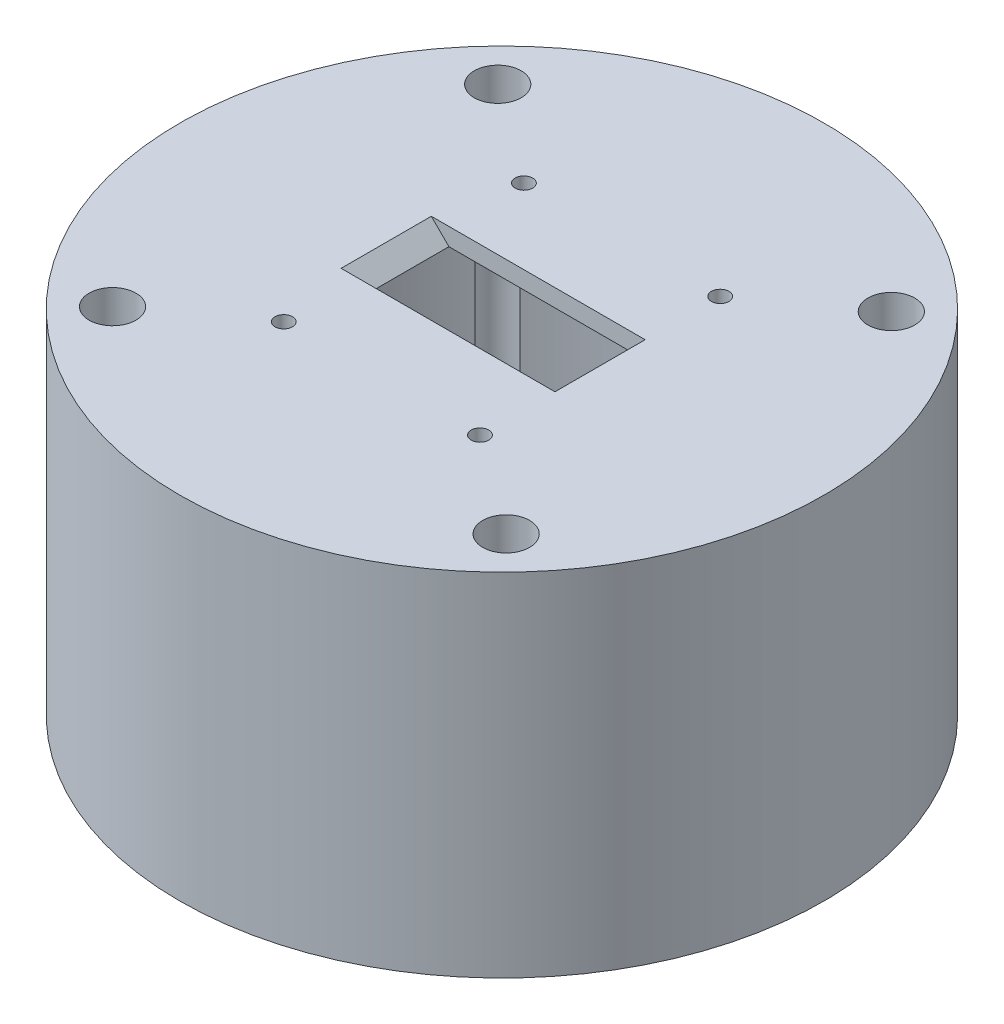
ISO-10303-21;
HEADER;
FILE_DESCRIPTION(('STEP AP214'),'2;1');
FILE_NAME('part.step','',(''),(''),'','','');
FILE_SCHEMA(('AUTOMOTIVE_DESIGN { 1 0 10303 214 1 1 1 1 }'));
ENDSEC;
DATA;
#1=APPLICATION_CONTEXT('core data for automotive mechanical design processes');
#2=APPLICATION_PROTOCOL_DEFINITION('international standard','automotive_design',2000,#1);
#3=PRODUCT_CONTEXT('',#1,'mechanical');
#4=PRODUCT('Part','Part','',(#3));
#5=PRODUCT_RELATED_PRODUCT_CATEGORY('part','',(#4));
#6=PRODUCT_DEFINITION_FORMATION('','',#4);
#7=PRODUCT_DEFINITION_CONTEXT('part definition',#1,'design');
#8=PRODUCT_DEFINITION('design','',#6,#7);
#9=PRODUCT_DEFINITION_SHAPE('','',#8);
#10=(LENGTH_UNIT() NAMED_UNIT(*) SI_UNIT(.MILLI.,.METRE.));
#11=(NAMED_UNIT(*) PLANE_ANGLE_UNIT() SI_UNIT($,.RADIAN.));
#12=(NAMED_UNIT(*) SI_UNIT($,.STERADIAN.) SOLID_ANGLE_UNIT());
#13=UNCERTAINTY_MEASURE_WITH_UNIT(LENGTH_MEASURE(1.E-05),#10,'distance_accuracy_value','');
#14=(GEOMETRIC_REPRESENTATION_CONTEXT(3) GLOBAL_UNCERTAINTY_ASSIGNED_CONTEXT((#13)) GLOBAL_UNIT_ASSIGNED_CONTEXT((#10,
#11,#12)) REPRESENTATION_CONTEXT('',''));
#15=CARTESIAN_POINT('',(0.,0.,0.));
#16=DIRECTION('',(0.,0.,1.));
#17=DIRECTION('',(1.,0.,0.));
#18=AXIS2_PLACEMENT_3D('',#15,#16,#17);
#19=CARTESIAN_POINT('',(16.75,60.,-7.7));
#20=DIRECTION('',(1.,0.,0.));
#21=DIRECTION('',(0.,0.,-1.));
#22=AXIS2_PLACEMENT_3D('',#19,#20,#21);
#23=PLANE('',#22);
#24=DIRECTION('',(0.,0.,-1.));
#25=VECTOR('',#24,1.);
#26=CARTESIAN_POINT('',(16.75,57.,-7.7));
#27=LINE('',#26,#25);
#28=CARTESIAN_POINT('',(16.75,57.,7.7));
#29=VERTEX_POINT('',#28);
#30=CARTESIAN_POINT('',(16.75,57.,-7.7));
#31=VERTEX_POINT('',#30);
#32=EDGE_CURVE('E262',#29,#31,#27,.T.);
#33=ORIENTED_EDGE('',*,*,#32,.F.);
#34=DIRECTION('',(0.,-1.,0.));
#35=VECTOR('',#34,1.);
#36=CARTESIAN_POINT('',(16.75,60.,7.7));
#37=LINE('',#36,#35);
#38=CARTESIAN_POINT('',(16.75,60.,7.7));
#39=VERTEX_POINT('',#38);
#40=EDGE_CURVE('E328',#39,#29,#37,.T.);
#41=ORIENTED_EDGE('',*,*,#40,.F.);
#42=DIRECTION('',(0.,0.,1.));
#43=VECTOR('',#42,1.);
#44=CARTESIAN_POINT('',(16.75,60.,-7.7));
#45=LINE('',#44,#43);
#46=CARTESIAN_POINT('',(16.75,60.,-7.7));
#47=VERTEX_POINT('',#46);
#48=EDGE_CURVE('E324',#47,#39,#45,.T.);
#49=ORIENTED_EDGE('',*,*,#48,.F.);
#50=DIRECTION('',(0.,-1.,0.));
#51=VECTOR('',#50,1.);
#52=CARTESIAN_POINT('',(16.75,60.,-7.7));
#53=LINE('',#52,#51);
#54=EDGE_CURVE('E329',#47,#31,#53,.T.);
#55=ORIENTED_EDGE('',*,*,#54,.T.);
#56=EDGE_LOOP('',(#33,#41,#49,#55));
#57=FACE_BOUND('',#56,.T.);
#58=ADVANCED_FACE('F32',(#57),#23,.F.);
#59=CARTESIAN_POINT('',(-16.75,60.,-7.7));
#60=DIRECTION('',(0.,0.,-1.));
#61=DIRECTION('',(-1.,0.,0.));
#62=AXIS2_PLACEMENT_3D('',#59,#60,#61);
#63=PLANE('',#62);
#64=DIRECTION('',(-1.,0.,0.));
#65=VECTOR('',#64,1.);
#66=CARTESIAN_POINT('',(-16.75,57.,-7.7));
#67=LINE('',#66,#65);
#68=CARTESIAN_POINT('',(-16.75,57.,-7.7));
#69=VERTEX_POINT('',#68);
#70=EDGE_CURVE('E259',#31,#69,#67,.T.);
#71=ORIENTED_EDGE('',*,*,#70,.F.);
#72=ORIENTED_EDGE('',*,*,#54,.F.);
#73=DIRECTION('',(1.,0.,0.));
#74=VECTOR('',#73,1.);
#75=CARTESIAN_POINT('',(-16.75,60.,-7.7));
#76=LINE('',#75,#74);
#77=CARTESIAN_POINT('',(-19.75,60.,-7.7));
#78=VERTEX_POINT('',#77);
#79=EDGE_CURVE('E47',#78,#47,#76,.T.);
#80=ORIENTED_EDGE('',*,*,#79,.F.);
#81=DIRECTION('',(0.707106781186546,-0.707106781186549,0.));
#82=VECTOR('',#81,1.);
#83=CARTESIAN_POINT('',(-18.25,58.5,-7.7));
#84=LINE('',#83,#82);
#85=EDGE_CURVE('E40',#78,#69,#84,.T.);
#86=ORIENTED_EDGE('',*,*,#85,.T.);
#87=EDGE_LOOP('',(#71,#72,#80,#86));
#88=FACE_BOUND('',#87,.T.);
#89=ADVANCED_FACE('F362',(#88),#63,.F.);
#90=CARTESIAN_POINT('',(-16.75,60.,7.7));
#91=DIRECTION('',(0.,0.,1.));
#92=DIRECTION('',(1.,0.,0.));
#93=AXIS2_PLACEMENT_3D('',#90,#91,#92);
#94=PLANE('',#93);
#95=DIRECTION('',(1.,0.,0.));
#96=VECTOR('',#95,1.);
#97=CARTESIAN_POINT('',(-16.75,57.,7.7));
#98=LINE('',#97,#96);
#99=CARTESIAN_POINT('',(-16.75,57.,7.7));
#100=VERTEX_POINT('',#99);
#101=EDGE_CURVE('E255',#100,#29,#98,.T.);
#102=ORIENTED_EDGE('',*,*,#101,.F.);
#103=DIRECTION('',(-0.707106781186546,0.707106781186549,0.));
#104=VECTOR('',#103,1.);
#105=CARTESIAN_POINT('',(-18.25,58.5,7.7));
#106=LINE('',#105,#104);
#107=CARTESIAN_POINT('',(-19.75,60.,7.7));
#108=VERTEX_POINT('',#107);
#109=EDGE_CURVE('E11',#100,#108,#106,.T.);
#110=ORIENTED_EDGE('',*,*,#109,.T.);
#111=DIRECTION('',(-1.,0.,0.));
#112=VECTOR('',#111,1.);
#113=CARTESIAN_POINT('',(-16.75,60.,7.7));
#114=LINE('',#113,#112);
#115=EDGE_CURVE('E55',#39,#108,#114,.T.);
#116=ORIENTED_EDGE('',*,*,#115,.F.);
#117=ORIENTED_EDGE('',*,*,#40,.T.);
#118=EDGE_LOOP('',(#102,#110,#116,#117));
#119=FACE_BOUND('',#118,.T.);
#120=ADVANCED_FACE('F370',(#119),#94,.F.);
#121=CARTESIAN_POINT('',(-16.75,0.,-20.5));
#122=DIRECTION('',(0.,1.,0.));
#123=DIRECTION('',(0.,0.,1.));
#124=AXIS2_PLACEMENT_3D('',#121,#122,#123);
#125=CYLINDRICAL_SURFACE('',#124,1.5);
#126=CARTESIAN_POINT('',(-16.75,60.,-20.5));
#127=DIRECTION('',(0.,1.,0.));
#128=DIRECTION('',(0.,0.,1.));
#129=AXIS2_PLACEMENT_3D('',#126,#127,#128);
#130=CIRCLE('',#129,1.5);
#131=CARTESIAN_POINT('',(-16.75,60.,-19.));
#132=VERTEX_POINT('',#131);
#133=EDGE_CURVE('E321',#132,#132,#130,.T.);
#134=ORIENTED_EDGE('',*,*,#133,.T.);
#135=EDGE_LOOP('',(#134));
#136=FACE_BOUND('',#135,.T.);
#137=CARTESIAN_POINT('',(-16.75,57.,-20.5));
#138=DIRECTION('',(0.,-1.,0.));
#139=DIRECTION('',(0.,0.,-1.));
#140=AXIS2_PLACEMENT_3D('',#137,#138,#139);
#141=CIRCLE('',#140,1.5);
#142=CARTESIAN_POINT('',(-16.75,57.,-22.));
#143=VERTEX_POINT('',#142);
#144=EDGE_CURVE('E252',#143,#143,#141,.F.);
#145=ORIENTED_EDGE('',*,*,#144,.F.);
#146=EDGE_LOOP('',(#145));
#147=FACE_BOUND('',#146,.T.);
#148=ADVANCED_FACE('F459',(#136,#147),#125,.F.);
#149=CARTESIAN_POINT('',(16.75,0.,-20.5));
#150=DIRECTION('',(0.,1.,0.));
#151=DIRECTION('',(0.,0.,1.));
#152=AXIS2_PLACEMENT_3D('',#149,#150,#151);
#153=CYLINDRICAL_SURFACE('',#152,1.5);
#154=CARTESIAN_POINT('',(16.75,60.,-20.5));
#155=DIRECTION('',(0.,1.,0.));
#156=DIRECTION('',(0.,0.,1.));
#157=AXIS2_PLACEMENT_3D('',#154,#155,#156);
#158=CIRCLE('',#157,1.5);
#159=CARTESIAN_POINT('',(16.75,60.,-19.));
#160=VERTEX_POINT('',#159);
#161=EDGE_CURVE('E289',#160,#160,#158,.T.);
#162=ORIENTED_EDGE('',*,*,#161,.T.);
#163=EDGE_LOOP('',(#162));
#164=FACE_BOUND('',#163,.T.);
#165=CARTESIAN_POINT('',(16.75,57.,-20.5));
#166=DIRECTION('',(0.,-1.,0.));
#167=DIRECTION('',(0.,0.,-1.));
#168=AXIS2_PLACEMENT_3D('',#165,#166,#167);
#169=CIRCLE('',#168,1.5);
#170=CARTESIAN_POINT('',(16.75,57.,-22.));
#171=VERTEX_POINT('',#170);
#172=EDGE_CURVE('E249',#171,#171,#169,.F.);
#173=ORIENTED_EDGE('',*,*,#172,.F.);
#174=EDGE_LOOP('',(#173));
#175=FACE_BOUND('',#174,.T.);
#176=ADVANCED_FACE('F455',(#164,#175),#153,.F.);
#177=CARTESIAN_POINT('',(-16.75,0.,20.5));
#178=DIRECTION('',(0.,1.,0.));
#179=DIRECTION('',(0.,0.,1.));
#180=AXIS2_PLACEMENT_3D('',#177,#178,#179);
#181=CYLINDRICAL_SURFACE('',#180,1.5);
#182=CARTESIAN_POINT('',(-16.75,60.,20.5));
#183=DIRECTION('',(0.,1.,0.));
#184=DIRECTION('',(0.,0.,1.));
#185=AXIS2_PLACEMENT_3D('',#182,#183,#184);
#186=CIRCLE('',#185,1.5);
#187=CARTESIAN_POINT('',(-16.75,60.,22.));
#188=VERTEX_POINT('',#187);
#189=EDGE_CURVE('E293',#188,#188,#186,.T.);
#190=ORIENTED_EDGE('',*,*,#189,.T.);
#191=EDGE_LOOP('',(#190));
#192=FACE_BOUND('',#191,.T.);
#193=CARTESIAN_POINT('',(-16.75,57.,20.5));
#194=DIRECTION('',(0.,-1.,0.));
#195=DIRECTION('',(0.,0.,-1.));
#196=AXIS2_PLACEMENT_3D('',#193,#194,#195);
#197=CIRCLE('',#196,1.5);
#198=CARTESIAN_POINT('',(-16.75,57.,19.));
#199=VERTEX_POINT('',#198);
#200=EDGE_CURVE('E246',#199,#199,#197,.F.);
#201=ORIENTED_EDGE('',*,*,#200,.F.);
#202=EDGE_LOOP('',(#201));
#203=FACE_BOUND('',#202,.T.);
#204=ADVANCED_FACE('F458',(#192,#203),#181,.F.);
#205=CARTESIAN_POINT('',(16.75,0.,20.5));
#206=DIRECTION('',(0.,1.,0.));
#207=DIRECTION('',(0.,0.,1.));
#208=AXIS2_PLACEMENT_3D('',#205,#206,#207);
#209=CYLINDRICAL_SURFACE('',#208,1.5);
#210=CARTESIAN_POINT('',(16.75,60.,20.5));
#211=DIRECTION('',(0.,1.,0.));
#212=DIRECTION('',(0.,0.,1.));
#213=AXIS2_PLACEMENT_3D('',#210,#211,#212);
#214=CIRCLE('',#213,1.5);
#215=CARTESIAN_POINT('',(16.75,60.,22.));
#216=VERTEX_POINT('',#215);
#217=EDGE_CURVE('E268',#216,#216,#214,.T.);
#218=ORIENTED_EDGE('',*,*,#217,.T.);
#219=EDGE_LOOP('',(#218));
#220=FACE_BOUND('',#219,.T.);
#221=CARTESIAN_POINT('',(16.75,57.,20.5));
#222=DIRECTION('',(0.,-1.,0.));
#223=DIRECTION('',(0.,0.,-1.));
#224=AXIS2_PLACEMENT_3D('',#221,#222,#223);
#225=CIRCLE('',#224,1.5);
#226=CARTESIAN_POINT('',(16.75,57.,19.));
#227=VERTEX_POINT('',#226);
#228=EDGE_CURVE('E234',#227,#227,#225,.F.);
#229=ORIENTED_EDGE('',*,*,#228,.F.);
#230=EDGE_LOOP('',(#229));
#231=FACE_BOUND('',#230,.T.);
#232=ADVANCED_FACE('F463',(#220,#231),#209,.F.);
#233=CARTESIAN_POINT('',(0.,50.,0.));
#234=DIRECTION('',(0.,-1.,0.));
#235=DIRECTION('',(0.,0.,-1.));
#236=AXIS2_PLACEMENT_3D('',#233,#234,#235);
#237=CYLINDRICAL_SURFACE('',#236,50.);
#238=CARTESIAN_POINT('',(0.,50.,0.));
#239=DIRECTION('',(0.,-1.,0.));
#240=DIRECTION('',(0.,0.,-1.));
#241=AXIS2_PLACEMENT_3D('',#238,#239,#240);
#242=CIRCLE('',#241,50.);
#243=CARTESIAN_POINT('',(37.590562846943,50.,-32.9689184664895));
#244=VERTEX_POINT('',#243);
#245=CARTESIAN_POINT('',(37.590562846943,50.,32.9689184664894));
#246=VERTEX_POINT('',#245);
#247=EDGE_CURVE('E340',#244,#246,#242,.T.);
#248=ORIENTED_EDGE('',*,*,#247,.F.);
#249=DIRECTION('',(0.,1.,0.));
#250=VECTOR('',#249,1.);
#251=CARTESIAN_POINT('',(37.5905628469429,30.,-32.9689184664895));
#252=LINE('',#251,#250);
#253=CARTESIAN_POINT('',(37.5905628469429,0.,-32.9689184664896));
#254=VERTEX_POINT('',#253);
#255=EDGE_CURVE('E318',#244,#254,#252,.F.);
#256=ORIENTED_EDGE('',*,*,#255,.T.);
#257=CARTESIAN_POINT('',(0.,0.,0.));
#258=DIRECTION('',(0.,-1.,0.));
#259=DIRECTION('',(0.,0.,-1.));
#260=AXIS2_PLACEMENT_3D('',#257,#258,#259);
#261=CIRCLE('',#260,50.);
#262=CARTESIAN_POINT('',(37.5905628469429,0.,32.9689184664895));
#263=VERTEX_POINT('',#262);
#264=EDGE_CURVE('E339',#254,#263,#261,.T.);
#265=ORIENTED_EDGE('',*,*,#264,.T.);
#266=DIRECTION('',(0.,1.,0.));
#267=VECTOR('',#266,1.);
#268=CARTESIAN_POINT('',(37.5905628469429,30.,32.9689184664894));
#269=LINE('',#268,#267);
#270=EDGE_CURVE('E292',#263,#246,#269,.T.);
#271=ORIENTED_EDGE('',*,*,#270,.T.);
#272=EDGE_LOOP('',(#248,#256,#265,#271));
#273=FACE_BOUND('',#272,.T.);
#274=ADVANCED_FACE('F397',(#273),#237,.F.);
#275=CARTESIAN_POINT('',(-33.7747495446768,0.,-36.868228777558));
#276=VERTEX_POINT('',#275);
#277=CARTESIAN_POINT('',(33.7747495446768,0.,-36.868228777558));
#278=VERTEX_POINT('',#277);
#279=EDGE_CURVE('E332',#276,#278,#261,.T.);
#280=ORIENTED_EDGE('',*,*,#279,.T.);
#281=DIRECTION('',(0.,1.,0.));
#282=VECTOR('',#281,1.);
#283=CARTESIAN_POINT('',(33.7747495446767,30.,-36.868228777558));
#284=LINE('',#283,#282);
#285=CARTESIAN_POINT('',(33.7747495446767,50.,-36.8682287775581));
#286=VERTEX_POINT('',#285);
#287=EDGE_CURVE('E315',#278,#286,#284,.T.);
#288=ORIENTED_EDGE('',*,*,#287,.T.);
#289=CARTESIAN_POINT('',(-33.7747495446767,50.,-36.8682287775581));
#290=VERTEX_POINT('',#289);
#291=EDGE_CURVE('E335',#290,#286,#242,.T.);
#292=ORIENTED_EDGE('',*,*,#291,.F.);
#293=DIRECTION('',(0.,1.,0.));
#294=VECTOR('',#293,1.);
#295=CARTESIAN_POINT('',(-33.7747495446767,30.,-36.868228777558));
#296=LINE('',#295,#294);
#297=EDGE_CURVE('E312',#290,#276,#296,.F.);
#298=ORIENTED_EDGE('',*,*,#297,.T.);
#299=EDGE_LOOP('',(#280,#288,#292,#298));
#300=FACE_BOUND('',#299,.T.);
#301=ADVANCED_FACE('F440',(#300),#237,.F.);
#302=CARTESIAN_POINT('',(-37.5905628469429,0.,32.9689184664895));
#303=VERTEX_POINT('',#302);
#304=CARTESIAN_POINT('',(-37.5905628469429,0.,-32.9689184664895));
#305=VERTEX_POINT('',#304);
#306=EDGE_CURVE('E343',#303,#305,#261,.T.);
#307=ORIENTED_EDGE('',*,*,#306,.T.);
#308=DIRECTION('',(0.,1.,0.));
#309=VECTOR('',#308,1.);
#310=CARTESIAN_POINT('',(-37.5905628469429,30.,-32.9689184664894));
#311=LINE('',#310,#309);
#312=CARTESIAN_POINT('',(-37.590562846943,50.,-32.9689184664894));
#313=VERTEX_POINT('',#312);
#314=EDGE_CURVE('E309',#305,#313,#311,.T.);
#315=ORIENTED_EDGE('',*,*,#314,.T.);
#316=CARTESIAN_POINT('',(-37.590562846943,50.,32.9689184664894));
#317=VERTEX_POINT('',#316);
#318=EDGE_CURVE('E338',#317,#313,#242,.T.);
#319=ORIENTED_EDGE('',*,*,#318,.F.);
#320=DIRECTION('',(0.,1.,0.));
#321=VECTOR('',#320,1.);
#322=CARTESIAN_POINT('',(-37.5905628469429,30.,32.9689184664894));
#323=LINE('',#322,#321);
#324=EDGE_CURVE('E306',#317,#303,#323,.F.);
#325=ORIENTED_EDGE('',*,*,#324,.T.);
#326=EDGE_LOOP('',(#307,#315,#319,#325));
#327=FACE_BOUND('',#326,.T.);
#328=ADVANCED_FACE('F384',(#327),#237,.F.);
#329=CARTESIAN_POINT('',(0.,60.,0.));
#330=DIRECTION('',(0.,-1.,0.));
#331=DIRECTION('',(0.,0.,-1.));
#332=AXIS2_PLACEMENT_3D('',#329,#330,#331);
#333=CYLINDRICAL_SURFACE('',#332,55.);
#334=CARTESIAN_POINT('',(0.,60.,0.));
#335=DIRECTION('',(0.,1.,0.));
#336=DIRECTION('',(0.,0.,1.));
#337=AXIS2_PLACEMENT_3D('',#334,#335,#336);
#338=CIRCLE('',#337,55.);
#339=CARTESIAN_POINT('',(0.,60.,55.));
#340=VERTEX_POINT('',#339);
#341=EDGE_CURVE('E344',#340,#340,#338,.T.);
#342=ORIENTED_EDGE('',*,*,#341,.F.);
#343=EDGE_LOOP('',(#342));
#344=FACE_BOUND('',#343,.T.);
#345=CARTESIAN_POINT('',(0.,0.,0.));
#346=DIRECTION('',(0.,1.,0.));
#347=DIRECTION('',(0.,0.,1.));
#348=AXIS2_PLACEMENT_3D('',#345,#346,#347);
#349=CIRCLE('',#348,55.);
#350=CARTESIAN_POINT('',(0.,0.,55.));
#351=VERTEX_POINT('',#350);
#352=EDGE_CURVE('E348',#351,#351,#349,.T.);
#353=ORIENTED_EDGE('',*,*,#352,.T.);
#354=EDGE_LOOP('',(#353));
#355=FACE_BOUND('',#354,.T.);
#356=ADVANCED_FACE('F377',(#344,#355),#333,.T.);
#357=CARTESIAN_POINT('',(0.,60.,0.));
#358=DIRECTION('',(0.,1.,0.));
#359=DIRECTION('',(0.,0.,1.));
#360=AXIS2_PLACEMENT_3D('',#357,#358,#359);
#361=PLANE('',#360);
#362=CARTESIAN_POINT('',(33.5917270558466,60.,-32.8724181253145));
#363=DIRECTION('',(0.,1.,0.));
#364=DIRECTION('',(0.,0.,1.));
#365=AXIS2_PLACEMENT_3D('',#362,#363,#364);
#366=CIRCLE('',#365,4.);
#367=CARTESIAN_POINT('',(33.5917270558466,60.,-28.8724181253145));
#368=VERTEX_POINT('',#367);
#369=EDGE_CURVE('E264',#368,#368,#366,.T.);
#370=ORIENTED_EDGE('',*,*,#369,.F.);
#371=EDGE_LOOP('',(#370));
#372=FACE_BOUND('',#371,.T.);
#373=CARTESIAN_POINT('',(-33.5917270558466,60.,-32.8724181253145));
#374=DIRECTION('',(0.,1.,0.));
#375=DIRECTION('',(0.,0.,1.));
#376=AXIS2_PLACEMENT_3D('',#373,#374,#375);
#377=CIRCLE('',#376,4.);
#378=CARTESIAN_POINT('',(-33.5917270558466,60.,-28.8724181253145));
#379=VERTEX_POINT('',#378);
#380=EDGE_CURVE('E281',#379,#379,#377,.T.);
#381=ORIENTED_EDGE('',*,*,#380,.F.);
#382=EDGE_LOOP('',(#381));
#383=FACE_BOUND('',#382,.T.);
#384=CARTESIAN_POINT('',(-33.5917270558466,60.,32.8724181253145));
#385=DIRECTION('',(0.,1.,0.));
#386=DIRECTION('',(0.,0.,1.));
#387=AXIS2_PLACEMENT_3D('',#384,#385,#386);
#388=CIRCLE('',#387,4.);
#389=CARTESIAN_POINT('',(-33.5917270558466,60.,36.8724181253145));
#390=VERTEX_POINT('',#389);
#391=EDGE_CURVE('E275',#390,#390,#388,.T.);
#392=ORIENTED_EDGE('',*,*,#391,.F.);
#393=EDGE_LOOP('',(#392));
#394=FACE_BOUND('',#393,.T.);
#395=CARTESIAN_POINT('',(33.5917270558466,60.,32.8724181253145));
#396=DIRECTION('',(0.,1.,0.));
#397=DIRECTION('',(0.,0.,1.));
#398=AXIS2_PLACEMENT_3D('',#395,#396,#397);
#399=CIRCLE('',#398,4.00000000000001);
#400=CARTESIAN_POINT('',(33.5917270558466,60.,36.8724181253145));
#401=VERTEX_POINT('',#400);
#402=EDGE_CURVE('E269',#401,#401,#399,.T.);
#403=ORIENTED_EDGE('',*,*,#402,.F.);
#404=EDGE_LOOP('',(#403));
#405=FACE_BOUND('',#404,.T.);
#406=ORIENTED_EDGE('',*,*,#217,.F.);
#407=EDGE_LOOP('',(#406));
#408=FACE_BOUND('',#407,.T.);
#409=ORIENTED_EDGE('',*,*,#189,.F.);
#410=EDGE_LOOP('',(#409));
#411=FACE_BOUND('',#410,.T.);
#412=ORIENTED_EDGE('',*,*,#161,.F.);
#413=EDGE_LOOP('',(#412));
#414=FACE_BOUND('',#413,.T.);
#415=ORIENTED_EDGE('',*,*,#133,.F.);
#416=EDGE_LOOP('',(#415));
#417=FACE_BOUND('',#416,.T.);
#418=DIRECTION('',(0.,0.,-1.));
#419=VECTOR('',#418,1.);
#420=CARTESIAN_POINT('',(-19.75,60.,-7.7));
#421=LINE('',#420,#419);
#422=EDGE_CURVE('E358',#108,#78,#421,.T.);
#423=ORIENTED_EDGE('',*,*,#422,.T.);
#424=ORIENTED_EDGE('',*,*,#79,.T.);
#425=ORIENTED_EDGE('',*,*,#48,.T.);
#426=ORIENTED_EDGE('',*,*,#115,.T.);
#427=EDGE_LOOP('',(#423,#424,#425,#426));
#428=FACE_BOUND('',#427,.T.);
#429=ORIENTED_EDGE('',*,*,#341,.T.);
#430=EDGE_LOOP('',(#429));
#431=FACE_BOUND('',#430,.T.);
#432=ADVANCED_FACE('F373',(#372,#383,#394,#405,#408,#411,#414,#417,#428,#431),#361,.T.);
#433=CARTESIAN_POINT('',(0.,0.,0.));
#434=DIRECTION('',(0.,1.,0.));
#435=DIRECTION('',(0.,0.,1.));
#436=AXIS2_PLACEMENT_3D('',#433,#434,#435);
#437=PLANE('',#436);
#438=ORIENTED_EDGE('',*,*,#264,.F.);
#439=CARTESIAN_POINT('',(33.5917270558466,0.,-32.8724181253145));
#440=DIRECTION('',(0.,1.,0.));
#441=DIRECTION('',(0.,0.,1.));
#442=AXIS2_PLACEMENT_3D('',#439,#440,#441);
#443=CIRCLE('',#442,4.);
#444=EDGE_CURVE('E284',#254,#278,#443,.T.);
#445=ORIENTED_EDGE('',*,*,#444,.T.);
#446=ORIENTED_EDGE('',*,*,#279,.F.);
#447=CARTESIAN_POINT('',(-33.5917270558466,0.,-32.8724181253145));
#448=DIRECTION('',(0.,1.,0.));
#449=DIRECTION('',(0.,0.,1.));
#450=AXIS2_PLACEMENT_3D('',#447,#448,#449);
#451=CIRCLE('',#450,4.);
#452=EDGE_CURVE('E278',#276,#305,#451,.T.);
#453=ORIENTED_EDGE('',*,*,#452,.T.);
#454=ORIENTED_EDGE('',*,*,#306,.F.);
#455=CARTESIAN_POINT('',(-33.5917270558466,0.,32.8724181253145));
#456=DIRECTION('',(0.,1.,0.));
#457=DIRECTION('',(0.,0.,1.));
#458=AXIS2_PLACEMENT_3D('',#455,#456,#457);
#459=CIRCLE('',#458,4.);
#460=CARTESIAN_POINT('',(-33.7747495446768,0.,36.868228777558));
#461=VERTEX_POINT('',#460);
#462=EDGE_CURVE('E272',#303,#461,#459,.T.);
#463=ORIENTED_EDGE('',*,*,#462,.T.);
#464=CARTESIAN_POINT('',(33.7747495446768,0.,36.868228777558));
#465=VERTEX_POINT('',#464);
#466=EDGE_CURVE('E686',#465,#461,#261,.T.);
#467=ORIENTED_EDGE('',*,*,#466,.F.);
#468=CARTESIAN_POINT('',(33.5917270558466,0.,32.8724181253145));
#469=DIRECTION('',(0.,1.,0.));
#470=DIRECTION('',(0.,0.,1.));
#471=AXIS2_PLACEMENT_3D('',#468,#469,#470);
#472=CIRCLE('',#471,4.00000000000001);
#473=EDGE_CURVE('E265',#465,#263,#472,.T.);
#474=ORIENTED_EDGE('',*,*,#473,.T.);
#475=EDGE_LOOP('',(#438,#445,#446,#453,#454,#463,#467,#474));
#476=FACE_BOUND('',#475,.T.);
#477=ORIENTED_EDGE('',*,*,#352,.F.);
#478=EDGE_LOOP('',(#477));
#479=FACE_BOUND('',#478,.T.);
#480=ADVANCED_FACE('F376',(#476,#479),#437,.F.);
#481=ORIENTED_EDGE('',*,*,#466,.T.);
#482=DIRECTION('',(0.,1.,0.));
#483=VECTOR('',#482,1.);
#484=CARTESIAN_POINT('',(-33.7747495446767,30.,36.868228777558));
#485=LINE('',#484,#483);
#486=CARTESIAN_POINT('',(-33.7747495446767,50.,36.8682287775581));
#487=VERTEX_POINT('',#486);
#488=EDGE_CURVE('E303',#461,#487,#485,.T.);
#489=ORIENTED_EDGE('',*,*,#488,.T.);
#490=CARTESIAN_POINT('',(33.7747495446767,50.,36.8682287775581));
#491=VERTEX_POINT('',#490);
#492=EDGE_CURVE('E427',#491,#487,#242,.T.);
#493=ORIENTED_EDGE('',*,*,#492,.F.);
#494=DIRECTION('',(0.,1.,0.));
#495=VECTOR('',#494,1.);
#496=CARTESIAN_POINT('',(33.7747495446767,30.,36.868228777558));
#497=LINE('',#496,#495);
#498=EDGE_CURVE('E300',#491,#465,#497,.F.);
#499=ORIENTED_EDGE('',*,*,#498,.T.);
#500=EDGE_LOOP('',(#481,#489,#493,#499));
#501=FACE_BOUND('',#500,.T.);
#502=ADVANCED_FACE('F388',(#501),#237,.F.);
#503=CARTESIAN_POINT('',(0.,50.,0.));
#504=DIRECTION('',(0.,-1.,0.));
#505=DIRECTION('',(0.,0.,-1.));
#506=AXIS2_PLACEMENT_3D('',#503,#504,#505);
#507=PLANE('',#506);
#508=CARTESIAN_POINT('',(22.5,50.,22.5));
#509=DIRECTION('',(0.,-1.,0.));
#510=DIRECTION('',(0.,0.,-1.));
#511=AXIS2_PLACEMENT_3D('',#508,#509,#510);
#512=CIRCLE('',#511,10.);
#513=CARTESIAN_POINT('',(32.5,50.,22.5));
#514=VERTEX_POINT('',#513);
#515=CARTESIAN_POINT('',(22.5,50.,32.5));
#516=VERTEX_POINT('',#515);
#517=EDGE_CURVE('E177',#514,#516,#512,.T.);
#518=ORIENTED_EDGE('',*,*,#517,.F.);
#519=DIRECTION('',(0.,0.,1.));
#520=VECTOR('',#519,1.);
#521=CARTESIAN_POINT('',(32.5,50.,-22.5));
#522=LINE('',#521,#520);
#523=CARTESIAN_POINT('',(32.5,50.,-22.5));
#524=VERTEX_POINT('',#523);
#525=EDGE_CURVE('E196',#524,#514,#522,.T.);
#526=ORIENTED_EDGE('',*,*,#525,.F.);
#527=CARTESIAN_POINT('',(22.5,50.,-22.5));
#528=DIRECTION('',(0.,-1.,0.));
#529=DIRECTION('',(0.,0.,1.));
#530=AXIS2_PLACEMENT_3D('',#527,#528,#529);
#531=CIRCLE('',#530,10.);
#532=CARTESIAN_POINT('',(22.5,50.,-32.5));
#533=VERTEX_POINT('',#532);
#534=EDGE_CURVE('E199',#533,#524,#531,.T.);
#535=ORIENTED_EDGE('',*,*,#534,.F.);
#536=DIRECTION('',(1.,0.,0.));
#537=VECTOR('',#536,1.);
#538=CARTESIAN_POINT('',(-22.5,50.,-32.5));
#539=LINE('',#538,#537);
#540=CARTESIAN_POINT('',(-22.5,50.,-32.5));
#541=VERTEX_POINT('',#540);
#542=EDGE_CURVE('E227',#541,#533,#539,.T.);
#543=ORIENTED_EDGE('',*,*,#542,.F.);
#544=CARTESIAN_POINT('',(-22.5,50.,-22.5));
#545=DIRECTION('',(0.,-1.,0.));
#546=DIRECTION('',(0.,0.,-1.));
#547=AXIS2_PLACEMENT_3D('',#544,#545,#546);
#548=CIRCLE('',#547,10.);
#549=CARTESIAN_POINT('',(-32.5,50.,-22.5));
#550=VERTEX_POINT('',#549);
#551=EDGE_CURVE('E224',#550,#541,#548,.T.);
#552=ORIENTED_EDGE('',*,*,#551,.F.);
#553=DIRECTION('',(0.,0.,-1.));
#554=VECTOR('',#553,1.);
#555=CARTESIAN_POINT('',(-32.5,50.,-22.5));
#556=LINE('',#555,#554);
#557=CARTESIAN_POINT('',(-32.5,50.,22.5));
#558=VERTEX_POINT('',#557);
#559=EDGE_CURVE('E221',#558,#550,#556,.T.);
#560=ORIENTED_EDGE('',*,*,#559,.F.);
#561=CARTESIAN_POINT('',(-22.5,50.,22.5));
#562=DIRECTION('',(0.,-1.,0.));
#563=DIRECTION('',(0.,0.,1.));
#564=AXIS2_PLACEMENT_3D('',#561,#562,#563);
#565=CIRCLE('',#564,10.);
#566=CARTESIAN_POINT('',(-22.5,50.,32.5));
#567=VERTEX_POINT('',#566);
#568=EDGE_CURVE('E218',#567,#558,#565,.T.);
#569=ORIENTED_EDGE('',*,*,#568,.F.);
#570=DIRECTION('',(-1.,0.,0.));
#571=VECTOR('',#570,1.);
#572=CARTESIAN_POINT('',(-22.5,50.,32.5));
#573=LINE('',#572,#571);
#574=EDGE_CURVE('E216',#516,#567,#573,.T.);
#575=ORIENTED_EDGE('',*,*,#574,.F.);
#576=EDGE_LOOP('',(#518,#526,#535,#543,#552,#560,#569,#575));
#577=FACE_BOUND('',#576,.T.);
#578=CARTESIAN_POINT('',(33.5917270558466,50.,-32.8724181253145));
#579=DIRECTION('',(0.,-1.,0.));
#580=DIRECTION('',(0.,0.,-1.));
#581=AXIS2_PLACEMENT_3D('',#578,#579,#580);
#582=CIRCLE('',#581,4.);
#583=EDGE_CURVE('E356',#244,#286,#582,.T.);
#584=ORIENTED_EDGE('',*,*,#583,.F.);
#585=ORIENTED_EDGE('',*,*,#247,.T.);
#586=CARTESIAN_POINT('',(33.5917270558466,50.,32.8724181253145));
#587=DIRECTION('',(0.,-1.,0.));
#588=DIRECTION('',(0.,0.,-1.));
#589=AXIS2_PLACEMENT_3D('',#586,#587,#588);
#590=CIRCLE('',#589,4.00000000000001);
#591=EDGE_CURVE('E347',#491,#246,#590,.T.);
#592=ORIENTED_EDGE('',*,*,#591,.F.);
#593=ORIENTED_EDGE('',*,*,#492,.T.);
#594=CARTESIAN_POINT('',(-33.5917270558466,50.,32.8724181253145));
#595=DIRECTION('',(0.,-1.,0.));
#596=DIRECTION('',(0.,0.,-1.));
#597=AXIS2_PLACEMENT_3D('',#594,#595,#596);
#598=CIRCLE('',#597,4.);
#599=EDGE_CURVE('E352',#317,#487,#598,.T.);
#600=ORIENTED_EDGE('',*,*,#599,.F.);
#601=ORIENTED_EDGE('',*,*,#318,.T.);
#602=CARTESIAN_POINT('',(-33.5917270558466,50.,-32.8724181253145));
#603=DIRECTION('',(0.,-1.,0.));
#604=DIRECTION('',(0.,0.,-1.));
#605=AXIS2_PLACEMENT_3D('',#602,#603,#604);
#606=CIRCLE('',#605,4.);
#607=EDGE_CURVE('E354',#290,#313,#606,.T.);
#608=ORIENTED_EDGE('',*,*,#607,.F.);
#609=ORIENTED_EDGE('',*,*,#291,.T.);
#610=EDGE_LOOP('',(#584,#585,#592,#593,#600,#601,#608,#609));
#611=FACE_BOUND('',#610,.T.);
#612=ADVANCED_FACE('F394',(#577,#611),#507,.T.);
#613=CARTESIAN_POINT('',(33.5917270558466,0.,32.8724181253145));
#614=DIRECTION('',(0.,1.,0.));
#615=DIRECTION('',(0.,0.,1.));
#616=AXIS2_PLACEMENT_3D('',#613,#614,#615);
#617=CYLINDRICAL_SURFACE('',#616,4.00000000000001);
#618=ORIENTED_EDGE('',*,*,#402,.T.);
#619=EDGE_LOOP('',(#618));
#620=FACE_BOUND('',#619,.T.);
#621=ORIENTED_EDGE('',*,*,#591,.T.);
#622=ORIENTED_EDGE('',*,*,#270,.F.);
#623=ORIENTED_EDGE('',*,*,#473,.F.);
#624=ORIENTED_EDGE('',*,*,#498,.F.);
#625=EDGE_LOOP('',(#621,#622,#623,#624));
#626=FACE_BOUND('',#625,.T.);
#627=ADVANCED_FACE('F408',(#620,#626),#617,.F.);
#628=CARTESIAN_POINT('',(-33.5917270558466,0.,32.8724181253145));
#629=DIRECTION('',(0.,1.,0.));
#630=DIRECTION('',(0.,0.,1.));
#631=AXIS2_PLACEMENT_3D('',#628,#629,#630);
#632=CYLINDRICAL_SURFACE('',#631,4.);
#633=ORIENTED_EDGE('',*,*,#391,.T.);
#634=EDGE_LOOP('',(#633));
#635=FACE_BOUND('',#634,.T.);
#636=ORIENTED_EDGE('',*,*,#599,.T.);
#637=ORIENTED_EDGE('',*,*,#488,.F.);
#638=ORIENTED_EDGE('',*,*,#462,.F.);
#639=ORIENTED_EDGE('',*,*,#324,.F.);
#640=EDGE_LOOP('',(#636,#637,#638,#639));
#641=FACE_BOUND('',#640,.T.);
#642=ADVANCED_FACE('F413',(#635,#641),#632,.F.);
#643=CARTESIAN_POINT('',(-33.5917270558466,0.,-32.8724181253145));
#644=DIRECTION('',(0.,1.,0.));
#645=DIRECTION('',(0.,0.,1.));
#646=AXIS2_PLACEMENT_3D('',#643,#644,#645);
#647=CYLINDRICAL_SURFACE('',#646,4.);
#648=ORIENTED_EDGE('',*,*,#380,.T.);
#649=EDGE_LOOP('',(#648));
#650=FACE_BOUND('',#649,.T.);
#651=ORIENTED_EDGE('',*,*,#607,.T.);
#652=ORIENTED_EDGE('',*,*,#314,.F.);
#653=ORIENTED_EDGE('',*,*,#452,.F.);
#654=ORIENTED_EDGE('',*,*,#297,.F.);
#655=EDGE_LOOP('',(#651,#652,#653,#654));
#656=FACE_BOUND('',#655,.T.);
#657=ADVANCED_FACE('F437',(#650,#656),#647,.F.);
#658=CARTESIAN_POINT('',(33.5917270558466,0.,-32.8724181253145));
#659=DIRECTION('',(0.,1.,0.));
#660=DIRECTION('',(0.,0.,1.));
#661=AXIS2_PLACEMENT_3D('',#658,#659,#660);
#662=CYLINDRICAL_SURFACE('',#661,4.);
#663=ORIENTED_EDGE('',*,*,#369,.T.);
#664=EDGE_LOOP('',(#663));
#665=FACE_BOUND('',#664,.T.);
#666=ORIENTED_EDGE('',*,*,#583,.T.);
#667=ORIENTED_EDGE('',*,*,#287,.F.);
#668=ORIENTED_EDGE('',*,*,#444,.F.);
#669=ORIENTED_EDGE('',*,*,#255,.F.);
#670=EDGE_LOOP('',(#666,#667,#668,#669));
#671=FACE_BOUND('',#670,.T.);
#672=ADVANCED_FACE('F441',(#665,#671),#662,.F.);
#673=CARTESIAN_POINT('',(22.5,57.,22.5));
#674=DIRECTION('',(0.,-1.,0.));
#675=DIRECTION('',(0.,0.,-1.));
#676=AXIS2_PLACEMENT_3D('',#673,#674,#675);
#677=PLANE('',#676);
#678=ORIENTED_EDGE('',*,*,#144,.T.);
#679=EDGE_LOOP('',(#678));
#680=FACE_BOUND('',#679,.T.);
#681=ORIENTED_EDGE('',*,*,#172,.T.);
#682=EDGE_LOOP('',(#681));
#683=FACE_BOUND('',#682,.T.);
#684=ORIENTED_EDGE('',*,*,#200,.T.);
#685=EDGE_LOOP('',(#684));
#686=FACE_BOUND('',#685,.T.);
#687=ORIENTED_EDGE('',*,*,#228,.T.);
#688=EDGE_LOOP('',(#687));
#689=FACE_BOUND('',#688,.T.);
#690=CARTESIAN_POINT('',(22.5,57.,22.5));
#691=DIRECTION('',(0.,-1.,0.));
#692=DIRECTION('',(0.,0.,-1.));
#693=AXIS2_PLACEMENT_3D('',#690,#691,#692);
#694=CIRCLE('',#693,10.);
#695=CARTESIAN_POINT('',(32.5,57.,22.5));
#696=VERTEX_POINT('',#695);
#697=CARTESIAN_POINT('',(22.5,57.,32.5));
#698=VERTEX_POINT('',#697);
#699=EDGE_CURVE('E174',#696,#698,#694,.T.);
#700=ORIENTED_EDGE('',*,*,#699,.T.);
#701=DIRECTION('',(-1.,0.,0.));
#702=VECTOR('',#701,1.);
#703=CARTESIAN_POINT('',(-22.5,57.,32.5));
#704=LINE('',#703,#702);
#705=CARTESIAN_POINT('',(-22.5,57.,32.5));
#706=VERTEX_POINT('',#705);
#707=EDGE_CURVE('E185',#698,#706,#704,.T.);
#708=ORIENTED_EDGE('',*,*,#707,.T.);
#709=CARTESIAN_POINT('',(-22.5,57.,22.5));
#710=DIRECTION('',(0.,-1.,0.));
#711=DIRECTION('',(0.,0.,1.));
#712=AXIS2_PLACEMENT_3D('',#709,#710,#711);
#713=CIRCLE('',#712,10.);
#714=CARTESIAN_POINT('',(-32.5,57.,22.5));
#715=VERTEX_POINT('',#714);
#716=EDGE_CURVE('E190',#706,#715,#713,.T.);
#717=ORIENTED_EDGE('',*,*,#716,.T.);
#718=DIRECTION('',(0.,0.,-1.));
#719=VECTOR('',#718,1.);
#720=CARTESIAN_POINT('',(-32.5,57.,-22.5));
#721=LINE('',#720,#719);
#722=CARTESIAN_POINT('',(-32.5,57.,-22.5));
#723=VERTEX_POINT('',#722);
#724=EDGE_CURVE('E203',#715,#723,#721,.T.);
#725=ORIENTED_EDGE('',*,*,#724,.T.);
#726=CARTESIAN_POINT('',(-22.5,57.,-22.5));
#727=DIRECTION('',(0.,-1.,0.));
#728=DIRECTION('',(0.,0.,-1.));
#729=AXIS2_PLACEMENT_3D('',#726,#727,#728);
#730=CIRCLE('',#729,10.);
#731=CARTESIAN_POINT('',(-22.5,57.,-32.5));
#732=VERTEX_POINT('',#731);
#733=EDGE_CURVE('E206',#723,#732,#730,.T.);
#734=ORIENTED_EDGE('',*,*,#733,.T.);
#735=DIRECTION('',(1.,0.,0.));
#736=VECTOR('',#735,1.);
#737=CARTESIAN_POINT('',(-22.5,57.,-32.5));
#738=LINE('',#737,#736);
#739=CARTESIAN_POINT('',(22.5,57.,-32.5));
#740=VERTEX_POINT('',#739);
#741=EDGE_CURVE('E209',#732,#740,#738,.T.);
#742=ORIENTED_EDGE('',*,*,#741,.T.);
#743=CARTESIAN_POINT('',(22.5,57.,-22.5));
#744=DIRECTION('',(0.,-1.,0.));
#745=DIRECTION('',(0.,0.,1.));
#746=AXIS2_PLACEMENT_3D('',#743,#744,#745);
#747=CIRCLE('',#746,10.);
#748=CARTESIAN_POINT('',(32.5,57.,-22.5));
#749=VERTEX_POINT('',#748);
#750=EDGE_CURVE('E212',#740,#749,#747,.T.);
#751=ORIENTED_EDGE('',*,*,#750,.T.);
#752=DIRECTION('',(0.,0.,1.));
#753=VECTOR('',#752,1.);
#754=CARTESIAN_POINT('',(32.5,57.,-22.5));
#755=LINE('',#754,#753);
#756=EDGE_CURVE('E182',#749,#696,#755,.T.);
#757=ORIENTED_EDGE('',*,*,#756,.T.);
#758=EDGE_LOOP('',(#700,#708,#717,#725,#734,#742,#751,#757));
#759=FACE_BOUND('',#758,.T.);
#760=ORIENTED_EDGE('',*,*,#32,.T.);
#761=ORIENTED_EDGE('',*,*,#70,.T.);
#762=DIRECTION('',(0.,0.,1.));
#763=VECTOR('',#762,1.);
#764=CARTESIAN_POINT('',(-16.75,57.,-7.7));
#765=LINE('',#764,#763);
#766=EDGE_CURVE('E257',#69,#100,#765,.T.);
#767=ORIENTED_EDGE('',*,*,#766,.T.);
#768=ORIENTED_EDGE('',*,*,#101,.T.);
#769=EDGE_LOOP('',(#760,#761,#767,#768));
#770=FACE_BOUND('',#769,.T.);
#771=ADVANCED_FACE('F192',(#680,#683,#686,#689,#759,#770),#677,.T.);
#772=CARTESIAN_POINT('',(22.5,57.,22.5));
#773=DIRECTION('',(0.,-1.,0.));
#774=DIRECTION('',(0.,0.,-1.));
#775=AXIS2_PLACEMENT_3D('',#772,#773,#774);
#776=CYLINDRICAL_SURFACE('',#775,10.);
#777=ORIENTED_EDGE('',*,*,#517,.T.);
#778=DIRECTION('',(0.,-1.,0.));
#779=VECTOR('',#778,1.);
#780=CARTESIAN_POINT('',(22.5,57.,32.5));
#781=LINE('',#780,#779);
#782=EDGE_CURVE('E170',#698,#516,#781,.T.);
#783=ORIENTED_EDGE('',*,*,#782,.F.);
#784=ORIENTED_EDGE('',*,*,#699,.F.);
#785=DIRECTION('',(0.,-1.,0.));
#786=VECTOR('',#785,1.);
#787=CARTESIAN_POINT('',(32.5,57.,22.5));
#788=LINE('',#787,#786);
#789=EDGE_CURVE('E232',#696,#514,#788,.T.);
#790=ORIENTED_EDGE('',*,*,#789,.T.);
#791=EDGE_LOOP('',(#777,#783,#784,#790));
#792=FACE_BOUND('',#791,.T.);
#793=ADVANCED_FACE('F172',(#792),#776,.F.);
#794=CARTESIAN_POINT('',(32.5,57.,-22.5));
#795=DIRECTION('',(1.,0.,0.));
#796=DIRECTION('',(0.,0.,-1.));
#797=AXIS2_PLACEMENT_3D('',#794,#795,#796);
#798=PLANE('',#797);
#799=ORIENTED_EDGE('',*,*,#525,.T.);
#800=ORIENTED_EDGE('',*,*,#789,.F.);
#801=ORIENTED_EDGE('',*,*,#756,.F.);
#802=DIRECTION('',(0.,-1.,0.));
#803=VECTOR('',#802,1.);
#804=CARTESIAN_POINT('',(32.5,57.,-22.5));
#805=LINE('',#804,#803);
#806=EDGE_CURVE('E235',#749,#524,#805,.T.);
#807=ORIENTED_EDGE('',*,*,#806,.T.);
#808=EDGE_LOOP('',(#799,#800,#801,#807));
#809=FACE_BOUND('',#808,.T.);
#810=ADVANCED_FACE('F554',(#809),#798,.F.);
#811=CARTESIAN_POINT('',(22.5,57.,-22.5));
#812=DIRECTION('',(0.,-1.,0.));
#813=DIRECTION('',(0.,0.,-1.));
#814=AXIS2_PLACEMENT_3D('',#811,#812,#813);
#815=CYLINDRICAL_SURFACE('',#814,10.);
#816=ORIENTED_EDGE('',*,*,#534,.T.);
#817=ORIENTED_EDGE('',*,*,#806,.F.);
#818=ORIENTED_EDGE('',*,*,#750,.F.);
#819=DIRECTION('',(0.,-1.,0.));
#820=VECTOR('',#819,1.);
#821=CARTESIAN_POINT('',(22.5,57.,-32.5));
#822=LINE('',#821,#820);
#823=EDGE_CURVE('E237',#740,#533,#822,.T.);
#824=ORIENTED_EDGE('',*,*,#823,.T.);
#825=EDGE_LOOP('',(#816,#817,#818,#824));
#826=FACE_BOUND('',#825,.T.);
#827=ADVANCED_FACE('F544',(#826),#815,.F.);
#828=CARTESIAN_POINT('',(-22.5,57.,-32.5));
#829=DIRECTION('',(0.,0.,-1.));
#830=DIRECTION('',(-1.,0.,0.));
#831=AXIS2_PLACEMENT_3D('',#828,#829,#830);
#832=PLANE('',#831);
#833=ORIENTED_EDGE('',*,*,#542,.T.);
#834=ORIENTED_EDGE('',*,*,#823,.F.);
#835=ORIENTED_EDGE('',*,*,#741,.F.);
#836=DIRECTION('',(0.,-1.,0.));
#837=VECTOR('',#836,1.);
#838=CARTESIAN_POINT('',(-22.5,57.,-32.5));
#839=LINE('',#838,#837);
#840=EDGE_CURVE('E239',#732,#541,#839,.T.);
#841=ORIENTED_EDGE('',*,*,#840,.T.);
#842=EDGE_LOOP('',(#833,#834,#835,#841));
#843=FACE_BOUND('',#842,.T.);
#844=ADVANCED_FACE('F534',(#843),#832,.F.);
#845=CARTESIAN_POINT('',(-22.5,57.,-22.5));
#846=DIRECTION('',(0.,-1.,0.));
#847=DIRECTION('',(0.,0.,-1.));
#848=AXIS2_PLACEMENT_3D('',#845,#846,#847);
#849=CYLINDRICAL_SURFACE('',#848,10.);
#850=ORIENTED_EDGE('',*,*,#551,.T.);
#851=ORIENTED_EDGE('',*,*,#840,.F.);
#852=ORIENTED_EDGE('',*,*,#733,.F.);
#853=DIRECTION('',(0.,-1.,0.));
#854=VECTOR('',#853,1.);
#855=CARTESIAN_POINT('',(-32.5,57.,-22.5));
#856=LINE('',#855,#854);
#857=EDGE_CURVE('E241',#723,#550,#856,.T.);
#858=ORIENTED_EDGE('',*,*,#857,.T.);
#859=EDGE_LOOP('',(#850,#851,#852,#858));
#860=FACE_BOUND('',#859,.T.);
#861=ADVANCED_FACE('F524',(#860),#849,.F.);
#862=CARTESIAN_POINT('',(-32.5,57.,-22.5));
#863=DIRECTION('',(-1.,0.,0.));
#864=DIRECTION('',(0.,0.,1.));
#865=AXIS2_PLACEMENT_3D('',#862,#863,#864);
#866=PLANE('',#865);
#867=ORIENTED_EDGE('',*,*,#559,.T.);
#868=ORIENTED_EDGE('',*,*,#857,.F.);
#869=ORIENTED_EDGE('',*,*,#724,.F.);
#870=DIRECTION('',(0.,-1.,0.));
#871=VECTOR('',#870,1.);
#872=CARTESIAN_POINT('',(-32.5,57.,22.5));
#873=LINE('',#872,#871);
#874=EDGE_CURVE('E243',#715,#558,#873,.T.);
#875=ORIENTED_EDGE('',*,*,#874,.T.);
#876=EDGE_LOOP('',(#867,#868,#869,#875));
#877=FACE_BOUND('',#876,.T.);
#878=ADVANCED_FACE('F514',(#877),#866,.F.);
#879=CARTESIAN_POINT('',(-22.5,57.,22.5));
#880=DIRECTION('',(0.,-1.,0.));
#881=DIRECTION('',(0.,0.,-1.));
#882=AXIS2_PLACEMENT_3D('',#879,#880,#881);
#883=CYLINDRICAL_SURFACE('',#882,10.);
#884=ORIENTED_EDGE('',*,*,#568,.T.);
#885=ORIENTED_EDGE('',*,*,#874,.F.);
#886=ORIENTED_EDGE('',*,*,#716,.F.);
#887=DIRECTION('',(0.,-1.,0.));
#888=VECTOR('',#887,1.);
#889=CARTESIAN_POINT('',(-22.5,57.,32.5));
#890=LINE('',#889,#888);
#891=EDGE_CURVE('E181',#706,#567,#890,.T.);
#892=ORIENTED_EDGE('',*,*,#891,.T.);
#893=EDGE_LOOP('',(#884,#885,#886,#892));
#894=FACE_BOUND('',#893,.T.);
#895=ADVANCED_FACE('F503',(#894),#883,.F.);
#896=CARTESIAN_POINT('',(-22.5,57.,32.5));
#897=DIRECTION('',(0.,0.,1.));
#898=DIRECTION('',(1.,0.,0.));
#899=AXIS2_PLACEMENT_3D('',#896,#897,#898);
#900=PLANE('',#899);
#901=ORIENTED_EDGE('',*,*,#574,.T.);
#902=ORIENTED_EDGE('',*,*,#891,.F.);
#903=ORIENTED_EDGE('',*,*,#707,.F.);
#904=ORIENTED_EDGE('',*,*,#782,.T.);
#905=EDGE_LOOP('',(#901,#902,#903,#904));
#906=FACE_BOUND('',#905,.T.);
#907=ADVANCED_FACE('F186',(#906),#900,.F.);
#908=CARTESIAN_POINT('',(-19.75,60.,0.));
#909=DIRECTION('',(0.707106781186549,0.707106781186546,0.));
#910=DIRECTION('',(0.,0.,1.));
#911=AXIS2_PLACEMENT_3D('',#908,#909,#910);
#912=PLANE('',#911);
#913=ORIENTED_EDGE('',*,*,#109,.F.);
#914=ORIENTED_EDGE('',*,*,#766,.F.);
#915=ORIENTED_EDGE('',*,*,#85,.F.);
#916=ORIENTED_EDGE('',*,*,#422,.F.);
#917=EDGE_LOOP('',(#913,#914,#915,#916));
#918=FACE_BOUND('',#917,.T.);
#919=ADVANCED_FACE('F34',(#918),#912,.T.);
#920=CLOSED_SHELL('',(#58,#89,#120,#148,#176,#204,#232,#274,#301,#328,#356,#432,#480,#502,#612,
#627,#642,#657,#672,#771,#793,#810,#827,#844,#861,#878,#895,#907,#919));
#921=MANIFOLD_SOLID_BREP('B2',#920);
#922=ADVANCED_BREP_SHAPE_REPRESENTATION('',(#18,#921),#14);
#923=SHAPE_DEFINITION_REPRESENTATION(#9,#922);
ENDSEC;
END-ISO-10303-21;
